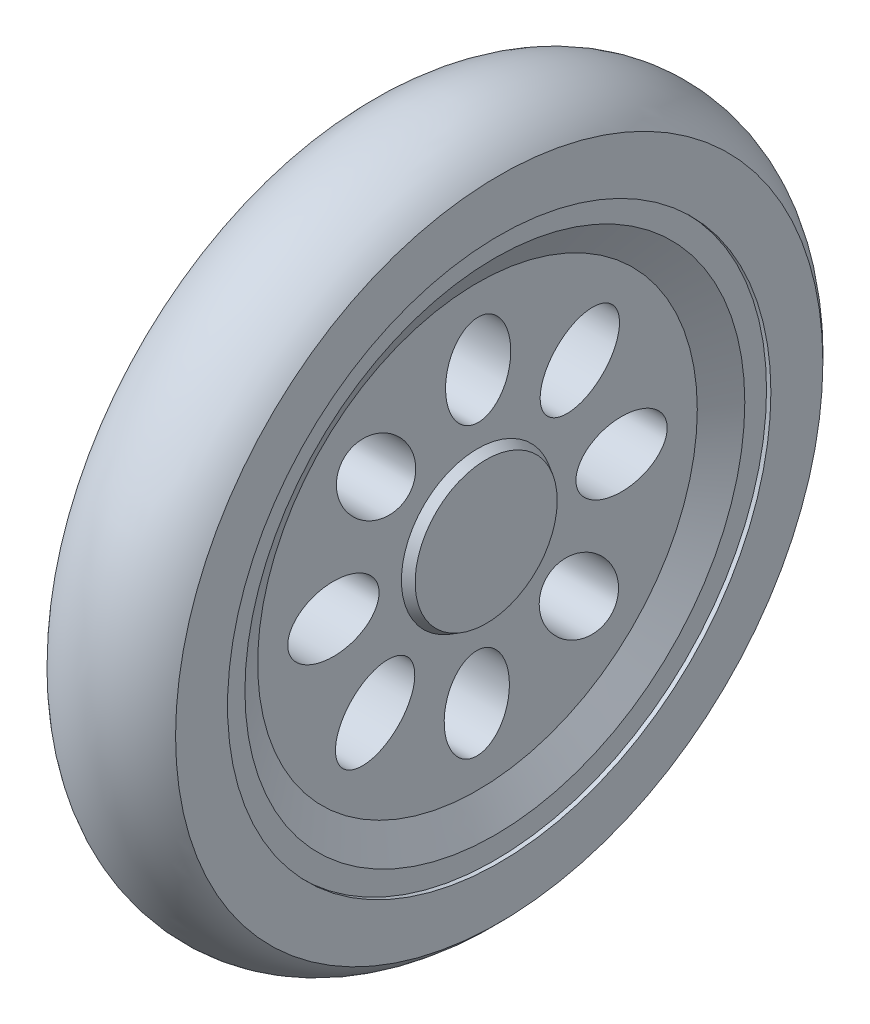
ISO-10303-21;
HEADER;
FILE_DESCRIPTION(('STEP AP214'),'2;1');
FILE_NAME('part.step','',(''),(''),'','','');
FILE_SCHEMA(('AUTOMOTIVE_DESIGN { 1 0 10303 214 1 1 1 1 }'));
ENDSEC;
DATA;
#1=APPLICATION_CONTEXT('core data for automotive mechanical design processes');
#2=APPLICATION_PROTOCOL_DEFINITION('international standard','automotive_design',2000,#1);
#3=PRODUCT_CONTEXT('',#1,'mechanical');
#4=PRODUCT('Part','Part','',(#3));
#5=PRODUCT_RELATED_PRODUCT_CATEGORY('part','',(#4));
#6=PRODUCT_DEFINITION_FORMATION('','',#4);
#7=PRODUCT_DEFINITION_CONTEXT('part definition',#1,'design');
#8=PRODUCT_DEFINITION('design','',#6,#7);
#9=PRODUCT_DEFINITION_SHAPE('','',#8);
#10=(LENGTH_UNIT() NAMED_UNIT(*) SI_UNIT(.MILLI.,.METRE.));
#11=(NAMED_UNIT(*) PLANE_ANGLE_UNIT() SI_UNIT($,.RADIAN.));
#12=(NAMED_UNIT(*) SI_UNIT($,.STERADIAN.) SOLID_ANGLE_UNIT());
#13=UNCERTAINTY_MEASURE_WITH_UNIT(LENGTH_MEASURE(1.E-05),#10,'distance_accuracy_value','');
#14=(GEOMETRIC_REPRESENTATION_CONTEXT(3) GLOBAL_UNCERTAINTY_ASSIGNED_CONTEXT((#13)) GLOBAL_UNIT_ASSIGNED_CONTEXT((#10,
#11,#12)) REPRESENTATION_CONTEXT('',''));
#15=CARTESIAN_POINT('',(0.,0.,0.));
#16=DIRECTION('',(0.,0.,1.));
#17=DIRECTION('',(1.,0.,0.));
#18=AXIS2_PLACEMENT_3D('',#15,#16,#17);
#19=CARTESIAN_POINT('',(15.,0.,0.));
#20=DIRECTION('',(1.,0.,0.));
#21=DIRECTION('',(0.,0.,-1.));
#22=AXIS2_PLACEMENT_3D('',#19,#20,#21);
#23=PLANE('',#22);
#24=CARTESIAN_POINT('',(15.,0.,0.));
#25=DIRECTION('',(1.,0.,0.));
#26=DIRECTION('',(0.,0.,-1.));
#27=AXIS2_PLACEMENT_3D('',#24,#25,#26);
#28=CIRCLE('',#27,31.75);
#29=CARTESIAN_POINT('',(15.,0.,-31.75));
#30=VERTEX_POINT('',#29);
#31=EDGE_CURVE('E47',#30,#30,#28,.T.);
#32=ORIENTED_EDGE('',*,*,#31,.F.);
#33=EDGE_LOOP('',(#32));
#34=FACE_BOUND('',#33,.T.);
#35=CARTESIAN_POINT('',(15.,0.,0.));
#36=DIRECTION('',(-1.,0.,0.));
#37=DIRECTION('',(0.,0.,1.));
#38=AXIS2_PLACEMENT_3D('',#35,#36,#37);
#39=CIRCLE('',#38,37.8238013100436);
#40=CARTESIAN_POINT('',(15.,0.,37.8238013100436));
#41=VERTEX_POINT('',#40);
#42=EDGE_CURVE('E116',#41,#41,#39,.T.);
#43=ORIENTED_EDGE('',*,*,#42,.F.);
#44=EDGE_LOOP('',(#43));
#45=FACE_BOUND('',#44,.T.);
#46=ADVANCED_FACE('F39',(#34,#45),#23,.T.);
#47=CARTESIAN_POINT('',(0.,0.,0.));
#48=DIRECTION('',(1.,0.,0.));
#49=DIRECTION('',(0.,0.,-1.));
#50=AXIS2_PLACEMENT_3D('',#47,#48,#49);
#51=PLANE('',#50);
#52=CARTESIAN_POINT('',(0.,0.,0.));
#53=DIRECTION('',(-1.,0.,0.));
#54=DIRECTION('',(0.,0.,1.));
#55=AXIS2_PLACEMENT_3D('',#52,#53,#54);
#56=CIRCLE('',#55,35.408);
#57=CARTESIAN_POINT('',(0.,0.,35.408));
#58=VERTEX_POINT('',#57);
#59=EDGE_CURVE('E121',#58,#58,#56,.T.);
#60=ORIENTED_EDGE('',*,*,#59,.F.);
#61=EDGE_LOOP('',(#60));
#62=FACE_BOUND('',#61,.T.);
#63=CARTESIAN_POINT('',(0.,0.,0.));
#64=DIRECTION('',(-1.,0.,0.));
#65=DIRECTION('',(0.,0.,1.));
#66=AXIS2_PLACEMENT_3D('',#63,#64,#65);
#67=CIRCLE('',#66,37.8238013100436);
#68=CARTESIAN_POINT('',(0.,0.,37.8238013100436));
#69=VERTEX_POINT('',#68);
#70=EDGE_CURVE('E118',#69,#69,#67,.T.);
#71=ORIENTED_EDGE('',*,*,#70,.T.);
#72=EDGE_LOOP('',(#71));
#73=FACE_BOUND('',#72,.T.);
#74=ADVANCED_FACE('F41',(#62,#73),#51,.F.);
#75=CARTESIAN_POINT('',(0.,16.8369244450523,-0.079644616975085));
#76=DIRECTION('',(1.,0.,0.));
#77=DIRECTION('',(0.,-1.,0.));
#78=AXIS2_PLACEMENT_3D('',#75,#76,#77);
#79=ELLIPSE('',#78,5.334,3.81);
#80=DIRECTION('',(1.,0.,0.));
#81=VECTOR('',#80,1.);
#82=SURFACE_OF_LINEAR_EXTRUSION('',#79,#81);
#83=CARTESIAN_POINT('',(12.46,16.8369244450523,-0.079644616975085));
#84=DIRECTION('',(1.,0.,0.));
#85=DIRECTION('',(0.,-1.,0.));
#86=AXIS2_PLACEMENT_3D('',#83,#84,#85);
#87=ELLIPSE('',#86,5.334,3.81);
#88=CARTESIAN_POINT('',(12.46,11.5029244450523,-0.079644616975085));
#89=VERTEX_POINT('',#88);
#90=EDGE_CURVE('E65',#89,#89,#87,.T.);
#91=ORIENTED_EDGE('',*,*,#90,.T.);
#92=EDGE_LOOP('',(#91));
#93=FACE_BOUND('',#92,.T.);
#94=CARTESIAN_POINT('',(2.286,16.8369244450523,-0.079644616975085));
#95=DIRECTION('',(1.,0.,0.));
#96=DIRECTION('',(0.,-1.,0.));
#97=AXIS2_PLACEMENT_3D('',#94,#95,#96);
#98=ELLIPSE('',#97,5.334,3.81);
#99=CARTESIAN_POINT('',(2.286,11.5029244450523,-0.079644616975085));
#100=VERTEX_POINT('',#99);
#101=EDGE_CURVE('E147',#100,#100,#98,.T.);
#102=ORIENTED_EDGE('',*,*,#101,.F.);
#103=EDGE_LOOP('',(#102));
#104=FACE_BOUND('',#103,.T.);
#105=ADVANCED_FACE('F73',(#93,#104),#82,.F.);
#106=CARTESIAN_POINT('',(0.,11.9618206981701,11.849186200674));
#107=DIRECTION('',(1.,0.,0.));
#108=DIRECTION('',(0.,-0.707106781186546,-0.707106781186549));
#109=AXIS2_PLACEMENT_3D('',#106,#107,#108);
#110=ELLIPSE('',#109,5.334,3.81);
#111=DIRECTION('',(1.,0.,0.));
#112=VECTOR('',#111,1.);
#113=SURFACE_OF_LINEAR_EXTRUSION('',#110,#112);
#114=CARTESIAN_POINT('',(12.46,11.9618206981701,11.849186200674));
#115=DIRECTION('',(1.,0.,0.));
#116=DIRECTION('',(0.,-0.707106781186546,-0.707106781186549));
#117=AXIS2_PLACEMENT_3D('',#114,#115,#116);
#118=ELLIPSE('',#117,5.334,3.81);
#119=CARTESIAN_POINT('',(12.46,8.19011312732107,8.07747862982492));
#120=VERTEX_POINT('',#119);
#121=EDGE_CURVE('E68',#120,#120,#118,.T.);
#122=ORIENTED_EDGE('',*,*,#121,.T.);
#123=EDGE_LOOP('',(#122));
#124=FACE_BOUND('',#123,.T.);
#125=CARTESIAN_POINT('',(2.286,11.9618206981701,11.849186200674));
#126=DIRECTION('',(1.,0.,0.));
#127=DIRECTION('',(0.,-0.707106781186546,-0.707106781186549));
#128=AXIS2_PLACEMENT_3D('',#125,#126,#127);
#129=ELLIPSE('',#128,5.334,3.81);
#130=CARTESIAN_POINT('',(2.286,8.19011312732107,8.07747862982492));
#131=VERTEX_POINT('',#130);
#132=EDGE_CURVE('E144',#131,#131,#129,.T.);
#133=ORIENTED_EDGE('',*,*,#132,.F.);
#134=EDGE_LOOP('',(#133));
#135=FACE_BOUND('',#134,.T.);
#136=ADVANCED_FACE('F77',(#124,#135),#113,.F.);
#137=CARTESIAN_POINT('',(0.,0.0796446169750262,16.8369244450523));
#138=DIRECTION('',(1.,0.,0.));
#139=DIRECTION('',(0.,0.,-1.));
#140=AXIS2_PLACEMENT_3D('',#137,#138,#139);
#141=ELLIPSE('',#140,5.334,3.81);
#142=DIRECTION('',(1.,0.,0.));
#143=VECTOR('',#142,1.);
#144=SURFACE_OF_LINEAR_EXTRUSION('',#141,#143);
#145=CARTESIAN_POINT('',(12.46,0.0796446169750262,16.8369244450523));
#146=DIRECTION('',(1.,0.,0.));
#147=DIRECTION('',(0.,0.,-1.));
#148=AXIS2_PLACEMENT_3D('',#145,#146,#147);
#149=ELLIPSE('',#148,5.334,3.81);
#150=CARTESIAN_POINT('',(12.46,0.0796446169750448,11.5029244450523));
#151=VERTEX_POINT('',#150);
#152=EDGE_CURVE('E194',#151,#151,#149,.T.);
#153=ORIENTED_EDGE('',*,*,#152,.T.);
#154=EDGE_LOOP('',(#153));
#155=FACE_BOUND('',#154,.T.);
#156=CARTESIAN_POINT('',(2.286,0.0796446169750262,16.8369244450523));
#157=DIRECTION('',(1.,0.,0.));
#158=DIRECTION('',(0.,0.,-1.));
#159=AXIS2_PLACEMENT_3D('',#156,#157,#158);
#160=ELLIPSE('',#159,5.334,3.81);
#161=CARTESIAN_POINT('',(2.286,0.0796446169750448,11.5029244450523));
#162=VERTEX_POINT('',#161);
#163=EDGE_CURVE('E141',#162,#162,#160,.T.);
#164=ORIENTED_EDGE('',*,*,#163,.F.);
#165=EDGE_LOOP('',(#164));
#166=FACE_BOUND('',#165,.T.);
#167=ADVANCED_FACE('F187',(#155,#166),#144,.F.);
#168=CARTESIAN_POINT('',(0.,-11.849186200674,11.9618206981701));
#169=DIRECTION('',(1.,0.,0.));
#170=DIRECTION('',(0.,0.707106781186551,-0.707106781186544));
#171=AXIS2_PLACEMENT_3D('',#168,#169,#170);
#172=ELLIPSE('',#171,5.334,3.81);
#173=DIRECTION('',(1.,0.,0.));
#174=VECTOR('',#173,1.);
#175=SURFACE_OF_LINEAR_EXTRUSION('',#172,#174);
#176=CARTESIAN_POINT('',(12.46,-11.849186200674,11.9618206981701));
#177=DIRECTION('',(1.,0.,0.));
#178=DIRECTION('',(0.,0.707106781186551,-0.707106781186544));
#179=AXIS2_PLACEMENT_3D('',#176,#177,#178);
#180=ELLIPSE('',#179,5.334,3.81);
#181=CARTESIAN_POINT('',(12.46,-8.07747862982495,8.19011312732104));
#182=VERTEX_POINT('',#181);
#183=EDGE_CURVE('E192',#182,#182,#180,.T.);
#184=ORIENTED_EDGE('',*,*,#183,.T.);
#185=EDGE_LOOP('',(#184));
#186=FACE_BOUND('',#185,.T.);
#187=CARTESIAN_POINT('',(2.286,-11.849186200674,11.9618206981701));
#188=DIRECTION('',(1.,0.,0.));
#189=DIRECTION('',(0.,0.707106781186551,-0.707106781186544));
#190=AXIS2_PLACEMENT_3D('',#187,#188,#189);
#191=ELLIPSE('',#190,5.334,3.81);
#192=CARTESIAN_POINT('',(2.286,-8.07747862982495,8.19011312732104));
#193=VERTEX_POINT('',#192);
#194=EDGE_CURVE('E138',#193,#193,#191,.T.);
#195=ORIENTED_EDGE('',*,*,#194,.F.);
#196=EDGE_LOOP('',(#195));
#197=FACE_BOUND('',#196,.T.);
#198=ADVANCED_FACE('F184',(#186,#197),#175,.F.);
#199=CARTESIAN_POINT('',(0.,-16.8369244450523,0.079644616975085));
#200=DIRECTION('',(1.,0.,0.));
#201=DIRECTION('',(0.,1.,0.));
#202=AXIS2_PLACEMENT_3D('',#199,#200,#201);
#203=ELLIPSE('',#202,5.334,3.81);
#204=DIRECTION('',(1.,0.,0.));
#205=VECTOR('',#204,1.);
#206=SURFACE_OF_LINEAR_EXTRUSION('',#203,#205);
#207=CARTESIAN_POINT('',(12.46,-16.8369244450523,0.079644616975085));
#208=DIRECTION('',(1.,0.,0.));
#209=DIRECTION('',(0.,1.,0.));
#210=AXIS2_PLACEMENT_3D('',#207,#208,#209);
#211=ELLIPSE('',#210,5.334,3.81);
#212=CARTESIAN_POINT('',(12.46,-11.5029244450523,0.079644616975085));
#213=VERTEX_POINT('',#212);
#214=EDGE_CURVE('E177',#213,#213,#211,.T.);
#215=ORIENTED_EDGE('',*,*,#214,.T.);
#216=EDGE_LOOP('',(#215));
#217=FACE_BOUND('',#216,.T.);
#218=CARTESIAN_POINT('',(2.286,-16.8369244450523,0.079644616975085));
#219=DIRECTION('',(1.,0.,0.));
#220=DIRECTION('',(0.,1.,0.));
#221=AXIS2_PLACEMENT_3D('',#218,#219,#220);
#222=ELLIPSE('',#221,5.334,3.81);
#223=CARTESIAN_POINT('',(2.286,-11.5029244450523,0.079644616975085));
#224=VERTEX_POINT('',#223);
#225=EDGE_CURVE('E135',#224,#224,#222,.T.);
#226=ORIENTED_EDGE('',*,*,#225,.F.);
#227=EDGE_LOOP('',(#226));
#228=FACE_BOUND('',#227,.T.);
#229=ADVANCED_FACE('F181',(#217,#228),#206,.F.);
#230=CARTESIAN_POINT('',(0.,-11.96182069817,-11.8491862006741));
#231=DIRECTION('',(1.,0.,0.));
#232=DIRECTION('',(0.,0.707106781186541,0.707106781186554));
#233=AXIS2_PLACEMENT_3D('',#230,#231,#232);
#234=ELLIPSE('',#233,5.334,3.81);
#235=DIRECTION('',(1.,0.,0.));
#236=VECTOR('',#235,1.);
#237=SURFACE_OF_LINEAR_EXTRUSION('',#234,#236);
#238=CARTESIAN_POINT('',(12.46,-11.96182069817,-11.8491862006741));
#239=DIRECTION('',(1.,0.,0.));
#240=DIRECTION('',(0.,0.707106781186541,0.707106781186554));
#241=AXIS2_PLACEMENT_3D('',#238,#239,#240);
#242=ELLIPSE('',#241,5.334,3.81);
#243=CARTESIAN_POINT('',(12.46,-8.19011312732102,-8.07747862982498));
#244=VERTEX_POINT('',#243);
#245=EDGE_CURVE('E172',#244,#244,#242,.T.);
#246=ORIENTED_EDGE('',*,*,#245,.T.);
#247=EDGE_LOOP('',(#246));
#248=FACE_BOUND('',#247,.T.);
#249=CARTESIAN_POINT('',(2.286,-11.96182069817,-11.8491862006741));
#250=DIRECTION('',(1.,0.,0.));
#251=DIRECTION('',(0.,0.707106781186541,0.707106781186554));
#252=AXIS2_PLACEMENT_3D('',#249,#250,#251);
#253=ELLIPSE('',#252,5.334,3.81);
#254=CARTESIAN_POINT('',(2.286,-8.19011312732102,-8.07747862982498));
#255=VERTEX_POINT('',#254);
#256=EDGE_CURVE('E132',#255,#255,#253,.T.);
#257=ORIENTED_EDGE('',*,*,#256,.F.);
#258=EDGE_LOOP('',(#257));
#259=FACE_BOUND('',#258,.T.);
#260=ADVANCED_FACE('F164',(#248,#259),#237,.F.);
#261=CARTESIAN_POINT('',(0.,-0.0796446169749086,-16.8369244450523));
#262=DIRECTION('',(1.,0.,0.));
#263=DIRECTION('',(0.,0.,1.));
#264=AXIS2_PLACEMENT_3D('',#261,#262,#263);
#265=ELLIPSE('',#264,5.334,3.81);
#266=DIRECTION('',(1.,0.,0.));
#267=VECTOR('',#266,1.);
#268=SURFACE_OF_LINEAR_EXTRUSION('',#265,#267);
#269=CARTESIAN_POINT('',(12.46,-0.0796446169749086,-16.8369244450523));
#270=DIRECTION('',(1.,0.,0.));
#271=DIRECTION('',(0.,0.,1.));
#272=AXIS2_PLACEMENT_3D('',#269,#270,#271);
#273=ELLIPSE('',#272,5.334,3.81);
#274=CARTESIAN_POINT('',(12.46,-0.0796446169749645,-11.5029244450523));
#275=VERTEX_POINT('',#274);
#276=EDGE_CURVE('E170',#275,#275,#273,.T.);
#277=ORIENTED_EDGE('',*,*,#276,.T.);
#278=EDGE_LOOP('',(#277));
#279=FACE_BOUND('',#278,.T.);
#280=CARTESIAN_POINT('',(2.286,-0.0796446169749086,-16.8369244450523));
#281=DIRECTION('',(1.,0.,0.));
#282=DIRECTION('',(0.,0.,1.));
#283=AXIS2_PLACEMENT_3D('',#280,#281,#282);
#284=ELLIPSE('',#283,5.334,3.81);
#285=CARTESIAN_POINT('',(2.286,-0.0796446169749645,-11.5029244450523));
#286=VERTEX_POINT('',#285);
#287=EDGE_CURVE('E129',#286,#286,#284,.T.);
#288=ORIENTED_EDGE('',*,*,#287,.F.);
#289=EDGE_LOOP('',(#288));
#290=FACE_BOUND('',#289,.T.);
#291=ADVANCED_FACE('F158',(#279,#290),#268,.F.);
#292=CARTESIAN_POINT('',(0.,11.8491862006741,-11.96182069817));
#293=DIRECTION('',(1.,0.,0.));
#294=DIRECTION('',(0.,-0.707106781186556,0.707106781186539));
#295=AXIS2_PLACEMENT_3D('',#292,#293,#294);
#296=ELLIPSE('',#295,5.334,3.81);
#297=DIRECTION('',(1.,0.,0.));
#298=VECTOR('',#297,1.);
#299=SURFACE_OF_LINEAR_EXTRUSION('',#296,#298);
#300=CARTESIAN_POINT('',(12.46,11.8491862006741,-11.96182069817));
#301=DIRECTION('',(1.,0.,0.));
#302=DIRECTION('',(0.,-0.707106781186556,0.707106781186539));
#303=AXIS2_PLACEMENT_3D('',#300,#301,#302);
#304=ELLIPSE('',#303,5.334,3.81);
#305=CARTESIAN_POINT('',(12.46,8.07747862982501,-8.19011312732099));
#306=VERTEX_POINT('',#305);
#307=EDGE_CURVE('E150',#306,#306,#304,.T.);
#308=ORIENTED_EDGE('',*,*,#307,.T.);
#309=EDGE_LOOP('',(#308));
#310=FACE_BOUND('',#309,.T.);
#311=CARTESIAN_POINT('',(2.286,11.8491862006741,-11.96182069817));
#312=DIRECTION('',(1.,0.,0.));
#313=DIRECTION('',(0.,-0.707106781186556,0.707106781186539));
#314=AXIS2_PLACEMENT_3D('',#311,#312,#313);
#315=ELLIPSE('',#314,5.334,3.81);
#316=CARTESIAN_POINT('',(2.286,8.07747862982501,-8.19011312732099));
#317=VERTEX_POINT('',#316);
#318=EDGE_CURVE('E43',#317,#317,#315,.T.);
#319=ORIENTED_EDGE('',*,*,#318,.F.);
#320=EDGE_LOOP('',(#319));
#321=FACE_BOUND('',#320,.T.);
#322=ADVANCED_FACE('F94',(#310,#321),#299,.F.);
#323=CARTESIAN_POINT('',(12.46,0.,0.));
#324=DIRECTION('',(1.,0.,0.));
#325=DIRECTION('',(0.,0.,-1.));
#326=AXIS2_PLACEMENT_3D('',#323,#324,#325);
#327=PLANE('',#326);
#328=ORIENTED_EDGE('',*,*,#307,.F.);
#329=EDGE_LOOP('',(#328));
#330=FACE_BOUND('',#329,.T.);
#331=ORIENTED_EDGE('',*,*,#276,.F.);
#332=EDGE_LOOP('',(#331));
#333=FACE_BOUND('',#332,.T.);
#334=ORIENTED_EDGE('',*,*,#245,.F.);
#335=EDGE_LOOP('',(#334));
#336=FACE_BOUND('',#335,.T.);
#337=ORIENTED_EDGE('',*,*,#214,.F.);
#338=EDGE_LOOP('',(#337));
#339=FACE_BOUND('',#338,.T.);
#340=ORIENTED_EDGE('',*,*,#183,.F.);
#341=EDGE_LOOP('',(#340));
#342=FACE_BOUND('',#341,.T.);
#343=ORIENTED_EDGE('',*,*,#152,.F.);
#344=EDGE_LOOP('',(#343));
#345=FACE_BOUND('',#344,.T.);
#346=ORIENTED_EDGE('',*,*,#121,.F.);
#347=EDGE_LOOP('',(#346));
#348=FACE_BOUND('',#347,.T.);
#349=ORIENTED_EDGE('',*,*,#90,.F.);
#350=EDGE_LOOP('',(#349));
#351=FACE_BOUND('',#350,.T.);
#352=CARTESIAN_POINT('',(12.46,0.,0.));
#353=DIRECTION('',(1.,0.,0.));
#354=DIRECTION('',(0.,0.,-1.));
#355=AXIS2_PLACEMENT_3D('',#352,#353,#354);
#356=CIRCLE('',#355,25.69047275902);
#357=CARTESIAN_POINT('',(12.46,0.,-25.69047275902));
#358=VERTEX_POINT('',#357);
#359=EDGE_CURVE('E52',#358,#358,#356,.T.);
#360=ORIENTED_EDGE('',*,*,#359,.T.);
#361=EDGE_LOOP('',(#360));
#362=FACE_BOUND('',#361,.T.);
#363=CARTESIAN_POINT('',(12.46,0.,0.));
#364=DIRECTION('',(1.,0.,0.));
#365=DIRECTION('',(0.,0.,-1.));
#366=AXIS2_PLACEMENT_3D('',#363,#364,#365);
#367=CIRCLE('',#366,8.89);
#368=CARTESIAN_POINT('',(12.46,0.,-8.89));
#369=VERTEX_POINT('',#368);
#370=EDGE_CURVE('E62',#369,#369,#367,.T.);
#371=ORIENTED_EDGE('',*,*,#370,.F.);
#372=EDGE_LOOP('',(#371));
#373=FACE_BOUND('',#372,.T.);
#374=ADVANCED_FACE('F90',(#330,#333,#336,#339,#342,#345,#348,#351,#362,#373),#327,.T.);
#375=CARTESIAN_POINT('',(14.492,0.,0.));
#376=DIRECTION('',(1.,0.,0.));
#377=DIRECTION('',(0.,0.,-1.));
#378=AXIS2_PLACEMENT_3D('',#375,#376,#377);
#379=CYLINDRICAL_SURFACE('',#378,31.75);
#380=CARTESIAN_POINT('',(14.492,0.,0.));
#381=DIRECTION('',(1.,0.,0.));
#382=DIRECTION('',(0.,0.,-1.));
#383=AXIS2_PLACEMENT_3D('',#380,#381,#382);
#384=CIRCLE('',#383,31.75);
#385=CARTESIAN_POINT('',(14.492,0.,-31.75));
#386=VERTEX_POINT('',#385);
#387=EDGE_CURVE('E10',#386,#386,#384,.T.);
#388=ORIENTED_EDGE('',*,*,#387,.F.);
#389=EDGE_LOOP('',(#388));
#390=FACE_BOUND('',#389,.T.);
#391=ORIENTED_EDGE('',*,*,#31,.T.);
#392=EDGE_LOOP('',(#391));
#393=FACE_BOUND('',#392,.T.);
#394=ADVANCED_FACE('F93',(#390,#393),#379,.F.);
#395=CARTESIAN_POINT('',(14.492,0.,0.));
#396=DIRECTION('',(1.,0.,0.));
#397=DIRECTION('',(0.,0.,-1.));
#398=AXIS2_PLACEMENT_3D('',#395,#396,#397);
#399=PLANE('',#398);
#400=CARTESIAN_POINT('',(14.492,0.,0.));
#401=DIRECTION('',(1.,0.,0.));
#402=DIRECTION('',(0.,0.,-1.));
#403=AXIS2_PLACEMENT_3D('',#400,#401,#402);
#404=CIRCLE('',#403,29.21);
#405=CARTESIAN_POINT('',(14.492,0.,-29.21));
#406=VERTEX_POINT('',#405);
#407=EDGE_CURVE('E56',#406,#406,#404,.T.);
#408=ORIENTED_EDGE('',*,*,#407,.F.);
#409=EDGE_LOOP('',(#408));
#410=FACE_BOUND('',#409,.T.);
#411=ORIENTED_EDGE('',*,*,#387,.T.);
#412=EDGE_LOOP('',(#411));
#413=FACE_BOUND('',#412,.T.);
#414=ADVANCED_FACE('F98',(#410,#413),#399,.T.);
#415=CARTESIAN_POINT('',(14.492,0.,0.));
#416=DIRECTION('',(1.,0.,0.));
#417=DIRECTION('',(0.,0.,-1.));
#418=AXIS2_PLACEMENT_3D('',#415,#416,#417);
#419=CONICAL_SURFACE('',#418,29.21,1.0471975511966);
#420=ORIENTED_EDGE('',*,*,#359,.F.);
#421=EDGE_LOOP('',(#420));
#422=FACE_BOUND('',#421,.T.);
#423=ORIENTED_EDGE('',*,*,#407,.T.);
#424=EDGE_LOOP('',(#423));
#425=FACE_BOUND('',#424,.T.);
#426=ADVANCED_FACE('F88',(#422,#425),#419,.F.);
#427=CARTESIAN_POINT('',(12.46,0.,0.));
#428=DIRECTION('',(-1.,0.,0.));
#429=DIRECTION('',(0.,0.,-1.));
#430=AXIS2_PLACEMENT_3D('',#427,#428,#429);
#431=CONICAL_SURFACE('',#430,8.89,0.5235987755983);
#432=CARTESIAN_POINT('',(13.476,0.,0.));
#433=DIRECTION('',(1.,0.,0.));
#434=DIRECTION('',(0.,0.,-1.));
#435=AXIS2_PLACEMENT_3D('',#432,#433,#434);
#436=CIRCLE('',#435,8.30341212650334);
#437=CARTESIAN_POINT('',(13.476,0.,-8.30341212650334));
#438=VERTEX_POINT('',#437);
#439=EDGE_CURVE('E59',#438,#438,#436,.T.);
#440=ORIENTED_EDGE('',*,*,#439,.F.);
#441=EDGE_LOOP('',(#440));
#442=FACE_BOUND('',#441,.T.);
#443=ORIENTED_EDGE('',*,*,#370,.T.);
#444=EDGE_LOOP('',(#443));
#445=FACE_BOUND('',#444,.T.);
#446=ADVANCED_FACE('F84',(#442,#445),#431,.T.);
#447=CARTESIAN_POINT('',(13.476,0.,0.));
#448=DIRECTION('',(1.,0.,0.));
#449=DIRECTION('',(0.,0.,-1.));
#450=AXIS2_PLACEMENT_3D('',#447,#448,#449);
#451=PLANE('',#450);
#452=ORIENTED_EDGE('',*,*,#439,.T.);
#453=EDGE_LOOP('',(#452));
#454=FACE_BOUND('',#453,.T.);
#455=ADVANCED_FACE('F80',(#454),#451,.T.);
#456=CARTESIAN_POINT('',(2.286,0.,0.));
#457=DIRECTION('',(-1.,0.,0.));
#458=DIRECTION('',(0.,0.,1.));
#459=AXIS2_PLACEMENT_3D('',#456,#457,#458);
#460=PLANE('',#459);
#461=ORIENTED_EDGE('',*,*,#132,.T.);
#462=EDGE_LOOP('',(#461));
#463=FACE_BOUND('',#462,.T.);
#464=ORIENTED_EDGE('',*,*,#194,.T.);
#465=EDGE_LOOP('',(#464));
#466=FACE_BOUND('',#465,.T.);
#467=ORIENTED_EDGE('',*,*,#256,.T.);
#468=EDGE_LOOP('',(#467));
#469=FACE_BOUND('',#468,.T.);
#470=ORIENTED_EDGE('',*,*,#318,.T.);
#471=EDGE_LOOP('',(#470));
#472=FACE_BOUND('',#471,.T.);
#473=CARTESIAN_POINT('',(2.286,0.,0.));
#474=DIRECTION('',(-1.,0.,0.));
#475=DIRECTION('',(0.,0.,1.));
#476=AXIS2_PLACEMENT_3D('',#473,#474,#475);
#477=CIRCLE('',#476,35.408);
#478=CARTESIAN_POINT('',(2.286,0.,35.408));
#479=VERTEX_POINT('',#478);
#480=EDGE_CURVE('E124',#479,#479,#477,.T.);
#481=ORIENTED_EDGE('',*,*,#480,.T.);
#482=EDGE_LOOP('',(#481));
#483=FACE_BOUND('',#482,.T.);
#484=ORIENTED_EDGE('',*,*,#287,.T.);
#485=EDGE_LOOP('',(#484));
#486=FACE_BOUND('',#485,.T.);
#487=ORIENTED_EDGE('',*,*,#225,.T.);
#488=EDGE_LOOP('',(#487));
#489=FACE_BOUND('',#488,.T.);
#490=ORIENTED_EDGE('',*,*,#163,.T.);
#491=EDGE_LOOP('',(#490));
#492=FACE_BOUND('',#491,.T.);
#493=ORIENTED_EDGE('',*,*,#101,.T.);
#494=EDGE_LOOP('',(#493));
#495=FACE_BOUND('',#494,.T.);
#496=ADVANCED_FACE('F83',(#463,#466,#469,#472,#483,#486,#489,#492,#495),#460,.T.);
#497=CARTESIAN_POINT('',(2.286,0.,0.));
#498=DIRECTION('',(-1.,0.,0.));
#499=DIRECTION('',(0.,0.,1.));
#500=AXIS2_PLACEMENT_3D('',#497,#498,#499);
#501=CYLINDRICAL_SURFACE('',#500,35.408);
#502=ORIENTED_EDGE('',*,*,#480,.F.);
#503=EDGE_LOOP('',(#502));
#504=FACE_BOUND('',#503,.T.);
#505=ORIENTED_EDGE('',*,*,#59,.T.);
#506=EDGE_LOOP('',(#505));
#507=FACE_BOUND('',#506,.T.);
#508=ADVANCED_FACE('F160',(#504,#507),#501,.F.);
#509=CARTESIAN_POINT('',(7.5,0.,0.));
#510=DIRECTION('',(-1.,0.,0.));
#511=DIRECTION('',(0.,0.,1.));
#512=AXIS2_PLACEMENT_3D('',#509,#510,#511);
#513=TOROIDAL_SURFACE('',#512,31.3003279008547,9.94010590086415);
#514=ORIENTED_EDGE('',*,*,#42,.T.);
#515=EDGE_LOOP('',(#514));
#516=FACE_BOUND('',#515,.T.);
#517=ORIENTED_EDGE('',*,*,#70,.F.);
#518=EDGE_LOOP('',(#517));
#519=FACE_BOUND('',#518,.T.);
#520=ADVANCED_FACE('F222',(#516,#519),#513,.T.);
#521=CLOSED_SHELL('',(#46,#74,#105,#136,#167,#198,#229,#260,#291,#322,#374,#394,#414,#426,#446,
#455,#496,#508,#520));
#522=MANIFOLD_SOLID_BREP('B2',#521);
#523=ADVANCED_BREP_SHAPE_REPRESENTATION('',(#18,#522),#14);
#524=SHAPE_DEFINITION_REPRESENTATION(#9,#523);
ENDSEC;
END-ISO-10303-21;
